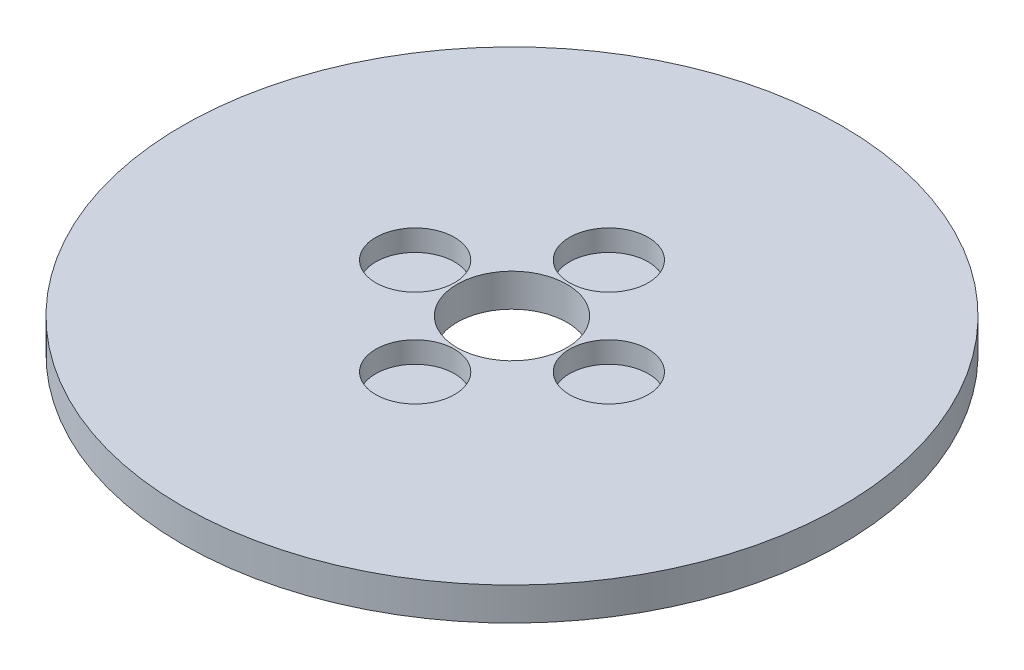
ISO-10303-21;
HEADER;
FILE_DESCRIPTION(('STEP AP214'),'2;1');
FILE_NAME('part.step','',(''),(''),'','','');
FILE_SCHEMA(('AUTOMOTIVE_DESIGN { 1 0 10303 214 1 1 1 1 }'));
ENDSEC;
DATA;
#1=APPLICATION_CONTEXT('core data for automotive mechanical design processes');
#2=APPLICATION_PROTOCOL_DEFINITION('international standard','automotive_design',2000,#1);
#3=PRODUCT_CONTEXT('',#1,'mechanical');
#4=PRODUCT('Part','Part','',(#3));
#5=PRODUCT_RELATED_PRODUCT_CATEGORY('part','',(#4));
#6=PRODUCT_DEFINITION_FORMATION('','',#4);
#7=PRODUCT_DEFINITION_CONTEXT('part definition',#1,'design');
#8=PRODUCT_DEFINITION('design','',#6,#7);
#9=PRODUCT_DEFINITION_SHAPE('','',#8);
#10=(LENGTH_UNIT() NAMED_UNIT(*) SI_UNIT(.MILLI.,.METRE.));
#11=(NAMED_UNIT(*) PLANE_ANGLE_UNIT() SI_UNIT($,.RADIAN.));
#12=(NAMED_UNIT(*) SI_UNIT($,.STERADIAN.) SOLID_ANGLE_UNIT());
#13=UNCERTAINTY_MEASURE_WITH_UNIT(LENGTH_MEASURE(1.E-05),#10,'distance_accuracy_value','');
#14=(GEOMETRIC_REPRESENTATION_CONTEXT(3) GLOBAL_UNCERTAINTY_ASSIGNED_CONTEXT((#13)) GLOBAL_UNIT_ASSIGNED_CONTEXT((#10,
#11,#12)) REPRESENTATION_CONTEXT('',''));
#15=CARTESIAN_POINT('',(0.,0.,0.));
#16=DIRECTION('',(0.,0.,1.));
#17=DIRECTION('',(1.,0.,0.));
#18=AXIS2_PLACEMENT_3D('',#15,#16,#17);
#19=CARTESIAN_POINT('',(0.,6.,0.));
#20=DIRECTION('',(0.,-1.,0.));
#21=DIRECTION('',(0.,0.,-1.));
#22=AXIS2_PLACEMENT_3D('',#19,#20,#21);
#23=CYLINDRICAL_SURFACE('',#22,60.);
#24=CARTESIAN_POINT('',(0.,6.,0.));
#25=DIRECTION('',(0.,1.,0.));
#26=DIRECTION('',(0.,0.,1.));
#27=AXIS2_PLACEMENT_3D('',#24,#25,#26);
#28=CIRCLE('',#27,60.);
#29=CARTESIAN_POINT('',(0.,6.,60.));
#30=VERTEX_POINT('',#29);
#31=EDGE_CURVE('E10',#30,#30,#28,.T.);
#32=ORIENTED_EDGE('',*,*,#31,.F.);
#33=EDGE_LOOP('',(#32));
#34=FACE_BOUND('',#33,.T.);
#35=CARTESIAN_POINT('',(0.,0.,0.));
#36=DIRECTION('',(0.,1.,0.));
#37=DIRECTION('',(0.,0.,1.));
#38=AXIS2_PLACEMENT_3D('',#35,#36,#37);
#39=CIRCLE('',#38,60.);
#40=CARTESIAN_POINT('',(0.,0.,60.));
#41=VERTEX_POINT('',#40);
#42=EDGE_CURVE('E37',#41,#41,#39,.T.);
#43=ORIENTED_EDGE('',*,*,#42,.T.);
#44=EDGE_LOOP('',(#43));
#45=FACE_BOUND('',#44,.T.);
#46=ADVANCED_FACE('F40',(#34,#45),#23,.T.);
#47=CARTESIAN_POINT('',(0.,6.,0.));
#48=DIRECTION('',(0.,1.,0.));
#49=DIRECTION('',(0.,0.,1.));
#50=AXIS2_PLACEMENT_3D('',#47,#48,#49);
#51=PLANE('',#50);
#52=CARTESIAN_POINT('',(0.,6.,17.6348314815398));
#53=DIRECTION('',(0.,1.,0.));
#54=DIRECTION('',(1.,0.,0.));
#55=AXIS2_PLACEMENT_3D('',#52,#53,#54);
#56=CIRCLE('',#55,7.16713873686793);
#57=CARTESIAN_POINT('',(0.,6.,24.8019702184078));
#58=VERTEX_POINT('',#57);
#59=EDGE_CURVE('E71',#58,#58,#56,.T.);
#60=ORIENTED_EDGE('',*,*,#59,.F.);
#61=EDGE_LOOP('',(#60));
#62=FACE_BOUND('',#61,.T.);
#63=CARTESIAN_POINT('',(17.6348314815398,6.,0.));
#64=DIRECTION('',(0.,1.,0.));
#65=DIRECTION('',(0.,0.,-1.));
#66=AXIS2_PLACEMENT_3D('',#63,#64,#65);
#67=CIRCLE('',#66,7.16713873686793);
#68=CARTESIAN_POINT('',(17.6348314815398,6.,7.16713873686793));
#69=VERTEX_POINT('',#68);
#70=EDGE_CURVE('E70',#69,#69,#67,.T.);
#71=ORIENTED_EDGE('',*,*,#70,.F.);
#72=EDGE_LOOP('',(#71));
#73=FACE_BOUND('',#72,.T.);
#74=CARTESIAN_POINT('',(-1.84715055094319E-13,6.,-17.6348314815398));
#75=DIRECTION('',(0.,1.,0.));
#76=DIRECTION('',(-1.,0.,0.));
#77=AXIS2_PLACEMENT_3D('',#74,#75,#76);
#78=CIRCLE('',#77,7.16713873686793);
#79=CARTESIAN_POINT('',(-1.84715055094319E-13,6.,-10.4676927446719));
#80=VERTEX_POINT('',#79);
#81=EDGE_CURVE('E61',#80,#80,#78,.T.);
#82=ORIENTED_EDGE('',*,*,#81,.F.);
#83=EDGE_LOOP('',(#82));
#84=FACE_BOUND('',#83,.T.);
#85=CARTESIAN_POINT('',(-17.6348314815398,6.,0.));
#86=DIRECTION('',(0.,1.,0.));
#87=DIRECTION('',(0.,0.,1.));
#88=AXIS2_PLACEMENT_3D('',#85,#86,#87);
#89=CIRCLE('',#88,7.16713873686793);
#90=CARTESIAN_POINT('',(-17.6348314815398,6.,7.16713873686793));
#91=VERTEX_POINT('',#90);
#92=EDGE_CURVE('E54',#91,#91,#89,.T.);
#93=ORIENTED_EDGE('',*,*,#92,.F.);
#94=EDGE_LOOP('',(#93));
#95=FACE_BOUND('',#94,.T.);
#96=CARTESIAN_POINT('',(0.,6.,0.));
#97=DIRECTION('',(0.,1.,0.));
#98=DIRECTION('',(0.,0.,1.));
#99=AXIS2_PLACEMENT_3D('',#96,#97,#98);
#100=CIRCLE('',#99,10.);
#101=CARTESIAN_POINT('',(0.,6.,10.));
#102=VERTEX_POINT('',#101);
#103=EDGE_CURVE('E50',#102,#102,#100,.T.);
#104=ORIENTED_EDGE('',*,*,#103,.F.);
#105=EDGE_LOOP('',(#104));
#106=FACE_BOUND('',#105,.T.);
#107=ORIENTED_EDGE('',*,*,#31,.T.);
#108=EDGE_LOOP('',(#107));
#109=FACE_BOUND('',#108,.T.);
#110=ADVANCED_FACE('F86',(#62,#73,#84,#95,#106,#109),#51,.T.);
#111=CARTESIAN_POINT('',(0.,0.,0.));
#112=DIRECTION('',(0.,1.,0.));
#113=DIRECTION('',(0.,0.,1.));
#114=AXIS2_PLACEMENT_3D('',#111,#112,#113);
#115=PLANE('',#114);
#116=CARTESIAN_POINT('',(0.,0.,0.));
#117=DIRECTION('',(0.,1.,0.));
#118=DIRECTION('',(0.,0.,1.));
#119=AXIS2_PLACEMENT_3D('',#116,#117,#118);
#120=CIRCLE('',#119,10.);
#121=CARTESIAN_POINT('',(0.,0.,10.));
#122=VERTEX_POINT('',#121);
#123=EDGE_CURVE('E47',#122,#122,#120,.T.);
#124=ORIENTED_EDGE('',*,*,#123,.T.);
#125=EDGE_LOOP('',(#124));
#126=FACE_BOUND('',#125,.T.);
#127=ORIENTED_EDGE('',*,*,#42,.F.);
#128=EDGE_LOOP('',(#127));
#129=FACE_BOUND('',#128,.T.);
#130=ADVANCED_FACE('F93',(#126,#129),#115,.F.);
#131=CARTESIAN_POINT('',(0.,6.,0.));
#132=DIRECTION('',(0.,-1.,0.));
#133=DIRECTION('',(0.,0.,-1.));
#134=AXIS2_PLACEMENT_3D('',#131,#132,#133);
#135=CYLINDRICAL_SURFACE('',#134,10.);
#136=ORIENTED_EDGE('',*,*,#103,.T.);
#137=EDGE_LOOP('',(#136));
#138=FACE_BOUND('',#137,.T.);
#139=ORIENTED_EDGE('',*,*,#123,.F.);
#140=EDGE_LOOP('',(#139));
#141=FACE_BOUND('',#140,.T.);
#142=ADVANCED_FACE('F101',(#138,#141),#135,.F.);
#143=CARTESIAN_POINT('',(-17.6348314815398,2.1339255998635,0.));
#144=DIRECTION('',(0.,1.,0.));
#145=DIRECTION('',(0.,0.,1.));
#146=AXIS2_PLACEMENT_3D('',#143,#144,#145);
#147=CYLINDRICAL_SURFACE('',#146,7.16713873686793);
#148=CARTESIAN_POINT('',(-17.6348314815398,2.1339255998635,0.));
#149=DIRECTION('',(0.,1.,0.));
#150=DIRECTION('',(0.,0.,1.));
#151=AXIS2_PLACEMENT_3D('',#148,#149,#150);
#152=CIRCLE('',#151,7.16713873686793);
#153=CARTESIAN_POINT('',(-17.6348314815398,2.1339255998635,7.16713873686793));
#154=VERTEX_POINT('',#153);
#155=EDGE_CURVE('E55',#154,#154,#152,.T.);
#156=CARTESIAN_POINT('',(-17.6348314815398,2.1339255998635,7.16713873686793));
#157=CARTESIAN_POINT('',(-17.6348314815398,2.17419720819826,7.16713873686793));
#158=CARTESIAN_POINT('',(-17.6348314815398,2.21446881653301,7.16713873686793));
#159=CARTESIAN_POINT('',(-17.6348314815398,2.29501203320252,7.16713873686793));
#160=CARTESIAN_POINT('',(-17.6348314815398,2.33528364153728,7.16713873686793));
#161=CARTESIAN_POINT('',(-17.6348314815398,2.41582685820679,7.16713873686793));
#162=CARTESIAN_POINT('',(-17.6348314815398,2.45609846654154,7.16713873686793));
#163=CARTESIAN_POINT('',(-17.6348314815398,2.53664168321105,7.16713873686793));
#164=CARTESIAN_POINT('',(-17.6348314815398,2.57691329154581,7.16713873686793));
#165=CARTESIAN_POINT('',(-17.6348314815398,2.65745650821532,7.16713873686793));
#166=CARTESIAN_POINT('',(-17.6348314815398,2.69772811655007,7.16713873686793));
#167=CARTESIAN_POINT('',(-17.6348314815398,2.77827133321958,7.16713873686793));
#168=CARTESIAN_POINT('',(-17.6348314815398,2.81854294155434,7.16713873686793));
#169=CARTESIAN_POINT('',(-17.6348314815398,2.89908615822385,7.16713873686793));
#170=CARTESIAN_POINT('',(-17.6348314815398,2.93935776655861,7.16713873686793));
#171=CARTESIAN_POINT('',(-17.6348314815398,3.01990098322812,7.16713873686793));
#172=CARTESIAN_POINT('',(-17.6348314815398,3.06017259156287,7.16713873686793));
#173=CARTESIAN_POINT('',(-17.6348314815398,3.14071580823238,7.16713873686793));
#174=CARTESIAN_POINT('',(-17.6348314815398,3.18098741656714,7.16713873686793));
#175=CARTESIAN_POINT('',(-17.6348314815398,3.26153063323665,7.16713873686793));
#176=CARTESIAN_POINT('',(-17.6348314815398,3.3018022415714,7.16713873686793));
#177=CARTESIAN_POINT('',(-17.6348314815398,3.38234545824091,7.16713873686793));
#178=CARTESIAN_POINT('',(-17.6348314815398,3.42261706657567,7.16713873686793));
#179=CARTESIAN_POINT('',(-17.6348314815398,3.50316028324518,7.16713873686793));
#180=CARTESIAN_POINT('',(-17.6348314815398,3.54343189157993,7.16713873686793));
#181=CARTESIAN_POINT('',(-17.6348314815398,3.62397510824944,7.16713873686793));
#182=CARTESIAN_POINT('',(-17.6348314815398,3.6642467165842,7.16713873686793));
#183=CARTESIAN_POINT('',(-17.6348314815398,3.74478993325371,7.16713873686793));
#184=CARTESIAN_POINT('',(-17.6348314815398,3.78506154158846,7.16713873686793));
#185=CARTESIAN_POINT('',(-17.6348314815398,3.86560475825797,7.16713873686793));
#186=CARTESIAN_POINT('',(-17.6348314815398,3.90587636659273,7.16713873686793));
#187=CARTESIAN_POINT('',(-17.6348314815398,3.98641958326224,7.16713873686793));
#188=CARTESIAN_POINT('',(-17.6348314815398,4.02669119159699,7.16713873686793));
#189=CARTESIAN_POINT('',(-17.6348314815398,4.10723440826651,7.16713873686793));
#190=CARTESIAN_POINT('',(-17.6348314815398,4.14750601660126,7.16713873686793));
#191=CARTESIAN_POINT('',(-17.6348314815398,4.22804923327077,7.16713873686793));
#192=CARTESIAN_POINT('',(-17.6348314815398,4.26832084160553,7.16713873686793));
#193=CARTESIAN_POINT('',(-17.6348314815398,4.34886405827504,7.16713873686793));
#194=CARTESIAN_POINT('',(-17.6348314815398,4.38913566660979,7.16713873686793));
#195=CARTESIAN_POINT('',(-17.6348314815398,4.4696788832793,7.16713873686793));
#196=CARTESIAN_POINT('',(-17.6348314815398,4.50995049161406,7.16713873686793));
#197=CARTESIAN_POINT('',(-17.6348314815398,4.59049370828357,7.16713873686793));
#198=CARTESIAN_POINT('',(-17.6348314815398,4.63076531661832,7.16713873686793));
#199=CARTESIAN_POINT('',(-17.6348314815398,4.71130853328783,7.16713873686793));
#200=CARTESIAN_POINT('',(-17.6348314815398,4.75158014162259,7.16713873686793));
#201=CARTESIAN_POINT('',(-17.6348314815398,4.8321233582921,7.16713873686793));
#202=CARTESIAN_POINT('',(-17.6348314815398,4.87239496662685,7.16713873686793));
#203=CARTESIAN_POINT('',(-17.6348314815398,4.95293818329636,7.16713873686793));
#204=CARTESIAN_POINT('',(-17.6348314815398,4.99320979163112,7.16713873686793));
#205=CARTESIAN_POINT('',(-17.6348314815398,5.07375300830063,7.16713873686793));
#206=CARTESIAN_POINT('',(-17.6348314815398,5.11402461663539,7.16713873686793));
#207=CARTESIAN_POINT('',(-17.6348314815398,5.1945678333049,7.16713873686793));
#208=CARTESIAN_POINT('',(-17.6348314815398,5.23483944163965,7.16713873686793));
#209=CARTESIAN_POINT('',(-17.6348314815398,5.31538265830916,7.16713873686793));
#210=CARTESIAN_POINT('',(-17.6348314815398,5.35565426664392,7.16713873686793));
#211=CARTESIAN_POINT('',(-17.6348314815398,5.43619748331343,7.16713873686793));
#212=CARTESIAN_POINT('',(-17.6348314815398,5.47646909164818,7.16713873686793));
#213=CARTESIAN_POINT('',(-17.6348314815398,5.55701230831769,7.16713873686793));
#214=CARTESIAN_POINT('',(-17.6348314815398,5.59728391665245,7.16713873686793));
#215=CARTESIAN_POINT('',(-17.6348314815398,5.67782713332196,7.16713873686793));
#216=CARTESIAN_POINT('',(-17.6348314815398,5.71809874165671,7.16713873686793));
#217=CARTESIAN_POINT('',(-17.6348314815398,5.79864195832622,7.16713873686793));
#218=CARTESIAN_POINT('',(-17.6348314815398,5.83891356666098,7.16713873686793));
#219=CARTESIAN_POINT('',(-17.6348314815398,5.91945678333049,7.16713873686793));
#220=CARTESIAN_POINT('',(-17.6348314815398,5.95972839166524,7.16713873686793));
#221=CARTESIAN_POINT('',(-17.6348314815398,6.,7.16713873686793));
#222=B_SPLINE_CURVE_WITH_KNOTS('',3,(#156,#157,#158,#159,#160,#161,#162,#163,#164,#165,#166,
#167,#168,#169,#170,#171,#172,#173,#174,#175,#176,#177,#178,#179,#180,#181,#182,#183,#184,#185,
#186,#187,#188,#189,#190,#191,#192,#193,#194,#195,#196,#197,#198,#199,#200,#201,#202,#203,#204,
#205,#206,#207,#208,#209,#210,#211,#212,#213,#214,#215,#216,#217,#218,#219,#220,#221),
.UNSPECIFIED.,.F.,.F.,(4,2,2,2,2,2,2,2,2,2,2,2,2,2,2,2,2,2,2,2,2,2,2,2,2,2,2,2,2,2,2,2,4),(0.,
0.120814825004265,0.241629650008531,0.362444475012796,0.483259300017062,0.604074125021328,
0.724888950025593,0.845703775029859,0.966518600034124,1.08733342503839,1.20814825004266,
1.32896307504692,1.44977790005119,1.57059272505545,1.69140755005972,1.81222237506398,
1.93303720006825,2.05385202507251,2.17466685007678,2.29548167508104,2.41629650008531,
2.53711132508958,2.65792615009384,2.77874097509811,2.89955580010237,3.02037062510664,
3.1411854501109,3.26200027511517,3.38281510011943,3.5036299251237,3.62444475012797,
3.74525957513223,3.8660744001365),.UNSPECIFIED.);
#223=EDGE_CURVE('BSEAM102',#154,#91,#222,.T.);
#224=ORIENTED_EDGE('',*,*,#155,.F.);
#225=ORIENTED_EDGE('',*,*,#92,.T.);
#226=ORIENTED_EDGE('',*,*,#223,.T.);
#227=ORIENTED_EDGE('',*,*,#223,.F.);
#228=EDGE_LOOP('',(#224,#226,#225,#227));
#229=FACE_BOUND('',#228,.T.);
#230=ADVANCED_FACE('F102',(#229),#147,.F.);
#231=CARTESIAN_POINT('',(-17.6348314815398,2.1339255998635,0.));
#232=DIRECTION('',(0.,1.,0.));
#233=DIRECTION('',(0.,0.,1.));
#234=AXIS2_PLACEMENT_3D('',#231,#232,#233);
#235=PLANE('',#234);
#236=ORIENTED_EDGE('',*,*,#155,.T.);
#237=EDGE_LOOP('',(#236));
#238=FACE_BOUND('',#237,.T.);
#239=ADVANCED_FACE('F133',(#238),#235,.T.);
#240=CARTESIAN_POINT('',(-1.84715055094319E-13,2.1339255998635,-17.6348314815398));
#241=DIRECTION('',(0.,1.,0.));
#242=DIRECTION('',(0.,0.,1.));
#243=AXIS2_PLACEMENT_3D('',#240,#241,#242);
#244=CYLINDRICAL_SURFACE('',#243,7.16713873686793);
#245=CARTESIAN_POINT('',(-1.84715055094319E-13,2.1339255998635,-17.6348314815398));
#246=DIRECTION('',(0.,1.,0.));
#247=DIRECTION('',(-1.,0.,0.));
#248=AXIS2_PLACEMENT_3D('',#245,#246,#247);
#249=CIRCLE('',#248,7.16713873686793);
#250=CARTESIAN_POINT('',(-1.84715055094319E-13,2.1339255998635,-10.4676927446719));
#251=VERTEX_POINT('',#250);
#252=EDGE_CURVE('E63',#251,#251,#249,.T.);
#253=CARTESIAN_POINT('',(-1.84715055094319E-13,2.1339255998635,-10.4676927446719));
#254=CARTESIAN_POINT('',(-1.84715055094319E-13,2.17419720819826,-10.4676927446719));
#255=CARTESIAN_POINT('',(-1.84715055094319E-13,2.21446881653301,-10.4676927446719));
#256=CARTESIAN_POINT('',(-1.84715055094319E-13,2.29501203320252,-10.4676927446719));
#257=CARTESIAN_POINT('',(-1.84715055094319E-13,2.33528364153728,-10.4676927446719));
#258=CARTESIAN_POINT('',(-1.84715055094319E-13,2.41582685820679,-10.4676927446719));
#259=CARTESIAN_POINT('',(-1.84715055094319E-13,2.45609846654154,-10.4676927446719));
#260=CARTESIAN_POINT('',(-1.84715055094319E-13,2.53664168321105,-10.4676927446719));
#261=CARTESIAN_POINT('',(-1.84715055094319E-13,2.57691329154581,-10.4676927446719));
#262=CARTESIAN_POINT('',(-1.84715055094319E-13,2.65745650821532,-10.4676927446719));
#263=CARTESIAN_POINT('',(-1.84715055094319E-13,2.69772811655007,-10.4676927446719));
#264=CARTESIAN_POINT('',(-1.84715055094319E-13,2.77827133321958,-10.4676927446719));
#265=CARTESIAN_POINT('',(-1.84715055094319E-13,2.81854294155434,-10.4676927446719));
#266=CARTESIAN_POINT('',(-1.84715055094319E-13,2.89908615822385,-10.4676927446719));
#267=CARTESIAN_POINT('',(-1.84715055094319E-13,2.93935776655861,-10.4676927446719));
#268=CARTESIAN_POINT('',(-1.84715055094319E-13,3.01990098322812,-10.4676927446719));
#269=CARTESIAN_POINT('',(-1.84715055094319E-13,3.06017259156287,-10.4676927446719));
#270=CARTESIAN_POINT('',(-1.84715055094319E-13,3.14071580823238,-10.4676927446719));
#271=CARTESIAN_POINT('',(-1.84715055094319E-13,3.18098741656714,-10.4676927446719));
#272=CARTESIAN_POINT('',(-1.84715055094319E-13,3.26153063323665,-10.4676927446719));
#273=CARTESIAN_POINT('',(-1.84715055094319E-13,3.3018022415714,-10.4676927446719));
#274=CARTESIAN_POINT('',(-1.84715055094319E-13,3.38234545824091,-10.4676927446719));
#275=CARTESIAN_POINT('',(-1.84715055094319E-13,3.42261706657567,-10.4676927446719));
#276=CARTESIAN_POINT('',(-1.84715055094319E-13,3.50316028324518,-10.4676927446719));
#277=CARTESIAN_POINT('',(-1.84715055094319E-13,3.54343189157993,-10.4676927446719));
#278=CARTESIAN_POINT('',(-1.84715055094319E-13,3.62397510824944,-10.4676927446719));
#279=CARTESIAN_POINT('',(-1.84715055094319E-13,3.6642467165842,-10.4676927446719));
#280=CARTESIAN_POINT('',(-1.84715055094319E-13,3.74478993325371,-10.4676927446719));
#281=CARTESIAN_POINT('',(-1.84715055094319E-13,3.78506154158846,-10.4676927446719));
#282=CARTESIAN_POINT('',(-1.84715055094319E-13,3.86560475825797,-10.4676927446719));
#283=CARTESIAN_POINT('',(-1.84715055094319E-13,3.90587636659273,-10.4676927446719));
#284=CARTESIAN_POINT('',(-1.84715055094319E-13,3.98641958326224,-10.4676927446719));
#285=CARTESIAN_POINT('',(-1.84715055094319E-13,4.02669119159699,-10.4676927446719));
#286=CARTESIAN_POINT('',(-1.84715055094319E-13,4.10723440826651,-10.4676927446719));
#287=CARTESIAN_POINT('',(-1.84715055094319E-13,4.14750601660126,-10.4676927446719));
#288=CARTESIAN_POINT('',(-1.84715055094319E-13,4.22804923327077,-10.4676927446719));
#289=CARTESIAN_POINT('',(-1.84715055094319E-13,4.26832084160553,-10.4676927446719));
#290=CARTESIAN_POINT('',(-1.84715055094319E-13,4.34886405827504,-10.4676927446719));
#291=CARTESIAN_POINT('',(-1.84715055094319E-13,4.38913566660979,-10.4676927446719));
#292=CARTESIAN_POINT('',(-1.84715055094319E-13,4.4696788832793,-10.4676927446719));
#293=CARTESIAN_POINT('',(-1.84715055094319E-13,4.50995049161406,-10.4676927446719));
#294=CARTESIAN_POINT('',(-1.84715055094319E-13,4.59049370828357,-10.4676927446719));
#295=CARTESIAN_POINT('',(-1.84715055094319E-13,4.63076531661832,-10.4676927446719));
#296=CARTESIAN_POINT('',(-1.84715055094319E-13,4.71130853328783,-10.4676927446719));
#297=CARTESIAN_POINT('',(-1.84715055094319E-13,4.75158014162259,-10.4676927446719));
#298=CARTESIAN_POINT('',(-1.84715055094319E-13,4.8321233582921,-10.4676927446719));
#299=CARTESIAN_POINT('',(-1.84715055094319E-13,4.87239496662685,-10.4676927446719));
#300=CARTESIAN_POINT('',(-1.84715055094319E-13,4.95293818329636,-10.4676927446719));
#301=CARTESIAN_POINT('',(-1.84715055094319E-13,4.99320979163112,-10.4676927446719));
#302=CARTESIAN_POINT('',(-1.84715055094319E-13,5.07375300830063,-10.4676927446719));
#303=CARTESIAN_POINT('',(-1.84715055094319E-13,5.11402461663539,-10.4676927446719));
#304=CARTESIAN_POINT('',(-1.84715055094319E-13,5.1945678333049,-10.4676927446719));
#305=CARTESIAN_POINT('',(-1.84715055094319E-13,5.23483944163965,-10.4676927446719));
#306=CARTESIAN_POINT('',(-1.84715055094319E-13,5.31538265830916,-10.4676927446719));
#307=CARTESIAN_POINT('',(-1.84715055094319E-13,5.35565426664392,-10.4676927446719));
#308=CARTESIAN_POINT('',(-1.84715055094319E-13,5.43619748331343,-10.4676927446719));
#309=CARTESIAN_POINT('',(-1.84715055094319E-13,5.47646909164818,-10.4676927446719));
#310=CARTESIAN_POINT('',(-1.84715055094319E-13,5.55701230831769,-10.4676927446719));
#311=CARTESIAN_POINT('',(-1.84715055094319E-13,5.59728391665245,-10.4676927446719));
#312=CARTESIAN_POINT('',(-1.84715055094319E-13,5.67782713332196,-10.4676927446719));
#313=CARTESIAN_POINT('',(-1.84715055094319E-13,5.71809874165671,-10.4676927446719));
#314=CARTESIAN_POINT('',(-1.84715055094319E-13,5.79864195832622,-10.4676927446719));
#315=CARTESIAN_POINT('',(-1.84715055094319E-13,5.83891356666098,-10.4676927446719));
#316=CARTESIAN_POINT('',(-1.84715055094319E-13,5.91945678333049,-10.4676927446719));
#317=CARTESIAN_POINT('',(-1.84715055094319E-13,5.95972839166524,-10.4676927446719));
#318=CARTESIAN_POINT('',(-1.84715055094319E-13,6.,-10.4676927446719));
#319=B_SPLINE_CURVE_WITH_KNOTS('',3,(#253,#254,#255,#256,#257,#258,#259,#260,#261,#262,#263,
#264,#265,#266,#267,#268,#269,#270,#271,#272,#273,#274,#275,#276,#277,#278,#279,#280,#281,#282,
#283,#284,#285,#286,#287,#288,#289,#290,#291,#292,#293,#294,#295,#296,#297,#298,#299,#300,#301,
#302,#303,#304,#305,#306,#307,#308,#309,#310,#311,#312,#313,#314,#315,#316,#317,#318),
.UNSPECIFIED.,.F.,.F.,(4,2,2,2,2,2,2,2,2,2,2,2,2,2,2,2,2,2,2,2,2,2,2,2,2,2,2,2,2,2,2,2,4),(0.,
0.120814825004265,0.241629650008531,0.362444475012796,0.483259300017062,0.604074125021328,
0.724888950025593,0.845703775029859,0.966518600034124,1.08733342503839,1.20814825004266,
1.32896307504692,1.44977790005119,1.57059272505545,1.69140755005972,1.81222237506398,
1.93303720006825,2.05385202507251,2.17466685007678,2.29548167508104,2.41629650008531,
2.53711132508958,2.65792615009384,2.77874097509811,2.89955580010237,3.02037062510664,
3.1411854501109,3.26200027511517,3.38281510011943,3.5036299251237,3.62444475012797,
3.74525957513223,3.8660744001365),.UNSPECIFIED.);
#320=EDGE_CURVE('BSEAM142',#251,#80,#319,.T.);
#321=ORIENTED_EDGE('',*,*,#252,.F.);
#322=ORIENTED_EDGE('',*,*,#81,.T.);
#323=ORIENTED_EDGE('',*,*,#320,.T.);
#324=ORIENTED_EDGE('',*,*,#320,.F.);
#325=EDGE_LOOP('',(#321,#323,#322,#324));
#326=FACE_BOUND('',#325,.T.);
#327=ADVANCED_FACE('F142',(#326),#244,.F.);
#328=CARTESIAN_POINT('',(-1.84715055094319E-13,2.1339255998635,-17.6348314815398));
#329=DIRECTION('',(0.,1.,0.));
#330=DIRECTION('',(-1.,0.,0.));
#331=AXIS2_PLACEMENT_3D('',#328,#329,#330);
#332=PLANE('',#331);
#333=ORIENTED_EDGE('',*,*,#252,.T.);
#334=EDGE_LOOP('',(#333));
#335=FACE_BOUND('',#334,.T.);
#336=ADVANCED_FACE('F156',(#335),#332,.T.);
#337=CARTESIAN_POINT('',(17.6348314815398,2.1339255998635,0.));
#338=DIRECTION('',(0.,1.,0.));
#339=DIRECTION('',(0.,0.,1.));
#340=AXIS2_PLACEMENT_3D('',#337,#338,#339);
#341=CYLINDRICAL_SURFACE('',#340,7.16713873686793);
#342=CARTESIAN_POINT('',(17.6348314815398,2.1339255998635,0.));
#343=DIRECTION('',(0.,1.,0.));
#344=DIRECTION('',(0.,0.,-1.));
#345=AXIS2_PLACEMENT_3D('',#342,#343,#344);
#346=CIRCLE('',#345,7.16713873686793);
#347=CARTESIAN_POINT('',(17.6348314815398,2.1339255998635,7.16713873686793));
#348=VERTEX_POINT('',#347);
#349=EDGE_CURVE('E69',#348,#348,#346,.T.);
#350=CARTESIAN_POINT('',(17.6348314815398,2.1339255998635,7.16713873686793));
#351=CARTESIAN_POINT('',(17.6348314815398,2.17419720819826,7.16713873686793));
#352=CARTESIAN_POINT('',(17.6348314815398,2.21446881653301,7.16713873686793));
#353=CARTESIAN_POINT('',(17.6348314815398,2.29501203320252,7.16713873686793));
#354=CARTESIAN_POINT('',(17.6348314815398,2.33528364153728,7.16713873686793));
#355=CARTESIAN_POINT('',(17.6348314815398,2.41582685820679,7.16713873686793));
#356=CARTESIAN_POINT('',(17.6348314815398,2.45609846654154,7.16713873686793));
#357=CARTESIAN_POINT('',(17.6348314815398,2.53664168321105,7.16713873686793));
#358=CARTESIAN_POINT('',(17.6348314815398,2.57691329154581,7.16713873686793));
#359=CARTESIAN_POINT('',(17.6348314815398,2.65745650821532,7.16713873686793));
#360=CARTESIAN_POINT('',(17.6348314815398,2.69772811655007,7.16713873686793));
#361=CARTESIAN_POINT('',(17.6348314815398,2.77827133321958,7.16713873686793));
#362=CARTESIAN_POINT('',(17.6348314815398,2.81854294155434,7.16713873686793));
#363=CARTESIAN_POINT('',(17.6348314815398,2.89908615822385,7.16713873686793));
#364=CARTESIAN_POINT('',(17.6348314815398,2.93935776655861,7.16713873686793));
#365=CARTESIAN_POINT('',(17.6348314815398,3.01990098322812,7.16713873686793));
#366=CARTESIAN_POINT('',(17.6348314815398,3.06017259156287,7.16713873686793));
#367=CARTESIAN_POINT('',(17.6348314815398,3.14071580823238,7.16713873686793));
#368=CARTESIAN_POINT('',(17.6348314815398,3.18098741656714,7.16713873686793));
#369=CARTESIAN_POINT('',(17.6348314815398,3.26153063323665,7.16713873686793));
#370=CARTESIAN_POINT('',(17.6348314815398,3.3018022415714,7.16713873686793));
#371=CARTESIAN_POINT('',(17.6348314815398,3.38234545824091,7.16713873686793));
#372=CARTESIAN_POINT('',(17.6348314815398,3.42261706657567,7.16713873686793));
#373=CARTESIAN_POINT('',(17.6348314815398,3.50316028324518,7.16713873686793));
#374=CARTESIAN_POINT('',(17.6348314815398,3.54343189157993,7.16713873686793));
#375=CARTESIAN_POINT('',(17.6348314815398,3.62397510824944,7.16713873686793));
#376=CARTESIAN_POINT('',(17.6348314815398,3.6642467165842,7.16713873686793));
#377=CARTESIAN_POINT('',(17.6348314815398,3.74478993325371,7.16713873686793));
#378=CARTESIAN_POINT('',(17.6348314815398,3.78506154158846,7.16713873686793));
#379=CARTESIAN_POINT('',(17.6348314815398,3.86560475825797,7.16713873686793));
#380=CARTESIAN_POINT('',(17.6348314815398,3.90587636659273,7.16713873686793));
#381=CARTESIAN_POINT('',(17.6348314815398,3.98641958326224,7.16713873686793));
#382=CARTESIAN_POINT('',(17.6348314815398,4.02669119159699,7.16713873686793));
#383=CARTESIAN_POINT('',(17.6348314815398,4.10723440826651,7.16713873686793));
#384=CARTESIAN_POINT('',(17.6348314815398,4.14750601660126,7.16713873686793));
#385=CARTESIAN_POINT('',(17.6348314815398,4.22804923327077,7.16713873686793));
#386=CARTESIAN_POINT('',(17.6348314815398,4.26832084160553,7.16713873686793));
#387=CARTESIAN_POINT('',(17.6348314815398,4.34886405827504,7.16713873686793));
#388=CARTESIAN_POINT('',(17.6348314815398,4.38913566660979,7.16713873686793));
#389=CARTESIAN_POINT('',(17.6348314815398,4.4696788832793,7.16713873686793));
#390=CARTESIAN_POINT('',(17.6348314815398,4.50995049161406,7.16713873686793));
#391=CARTESIAN_POINT('',(17.6348314815398,4.59049370828357,7.16713873686793));
#392=CARTESIAN_POINT('',(17.6348314815398,4.63076531661832,7.16713873686793));
#393=CARTESIAN_POINT('',(17.6348314815398,4.71130853328783,7.16713873686793));
#394=CARTESIAN_POINT('',(17.6348314815398,4.75158014162259,7.16713873686793));
#395=CARTESIAN_POINT('',(17.6348314815398,4.8321233582921,7.16713873686793));
#396=CARTESIAN_POINT('',(17.6348314815398,4.87239496662685,7.16713873686793));
#397=CARTESIAN_POINT('',(17.6348314815398,4.95293818329636,7.16713873686793));
#398=CARTESIAN_POINT('',(17.6348314815398,4.99320979163112,7.16713873686793));
#399=CARTESIAN_POINT('',(17.6348314815398,5.07375300830063,7.16713873686793));
#400=CARTESIAN_POINT('',(17.6348314815398,5.11402461663539,7.16713873686793));
#401=CARTESIAN_POINT('',(17.6348314815398,5.1945678333049,7.16713873686793));
#402=CARTESIAN_POINT('',(17.6348314815398,5.23483944163965,7.16713873686793));
#403=CARTESIAN_POINT('',(17.6348314815398,5.31538265830916,7.16713873686793));
#404=CARTESIAN_POINT('',(17.6348314815398,5.35565426664392,7.16713873686793));
#405=CARTESIAN_POINT('',(17.6348314815398,5.43619748331343,7.16713873686793));
#406=CARTESIAN_POINT('',(17.6348314815398,5.47646909164818,7.16713873686793));
#407=CARTESIAN_POINT('',(17.6348314815398,5.55701230831769,7.16713873686793));
#408=CARTESIAN_POINT('',(17.6348314815398,5.59728391665245,7.16713873686793));
#409=CARTESIAN_POINT('',(17.6348314815398,5.67782713332196,7.16713873686793));
#410=CARTESIAN_POINT('',(17.6348314815398,5.71809874165671,7.16713873686793));
#411=CARTESIAN_POINT('',(17.6348314815398,5.79864195832622,7.16713873686793));
#412=CARTESIAN_POINT('',(17.6348314815398,5.83891356666098,7.16713873686793));
#413=CARTESIAN_POINT('',(17.6348314815398,5.91945678333049,7.16713873686793));
#414=CARTESIAN_POINT('',(17.6348314815398,5.95972839166524,7.16713873686793));
#415=CARTESIAN_POINT('',(17.6348314815398,6.,7.16713873686793));
#416=B_SPLINE_CURVE_WITH_KNOTS('',3,(#350,#351,#352,#353,#354,#355,#356,#357,#358,#359,#360,
#361,#362,#363,#364,#365,#366,#367,#368,#369,#370,#371,#372,#373,#374,#375,#376,#377,#378,#379,
#380,#381,#382,#383,#384,#385,#386,#387,#388,#389,#390,#391,#392,#393,#394,#395,#396,#397,#398,
#399,#400,#401,#402,#403,#404,#405,#406,#407,#408,#409,#410,#411,#412,#413,#414,#415),
.UNSPECIFIED.,.F.,.F.,(4,2,2,2,2,2,2,2,2,2,2,2,2,2,2,2,2,2,2,2,2,2,2,2,2,2,2,2,2,2,2,2,4),(0.,
0.120814825004265,0.241629650008531,0.362444475012796,0.483259300017062,0.604074125021328,
0.724888950025593,0.845703775029859,0.966518600034124,1.08733342503839,1.20814825004266,
1.32896307504692,1.44977790005119,1.57059272505545,1.69140755005972,1.81222237506398,
1.93303720006825,2.05385202507251,2.17466685007678,2.29548167508104,2.41629650008531,
2.53711132508958,2.65792615009384,2.77874097509811,2.89955580010237,3.02037062510664,
3.1411854501109,3.26200027511517,3.38281510011943,3.5036299251237,3.62444475012797,
3.74525957513223,3.8660744001365),.UNSPECIFIED.);
#417=EDGE_CURVE('BSEAM164',#348,#69,#416,.T.);
#418=ORIENTED_EDGE('',*,*,#349,.F.);
#419=ORIENTED_EDGE('',*,*,#70,.T.);
#420=ORIENTED_EDGE('',*,*,#417,.T.);
#421=ORIENTED_EDGE('',*,*,#417,.F.);
#422=EDGE_LOOP('',(#418,#420,#419,#421));
#423=FACE_BOUND('',#422,.T.);
#424=ADVANCED_FACE('F164',(#423),#341,.F.);
#425=CARTESIAN_POINT('',(17.6348314815398,2.1339255998635,0.));
#426=DIRECTION('',(0.,1.,0.));
#427=DIRECTION('',(0.,0.,-1.));
#428=AXIS2_PLACEMENT_3D('',#425,#426,#427);
#429=PLANE('',#428);
#430=ORIENTED_EDGE('',*,*,#349,.T.);
#431=EDGE_LOOP('',(#430));
#432=FACE_BOUND('',#431,.T.);
#433=ADVANCED_FACE('F83',(#432),#429,.T.);
#434=CARTESIAN_POINT('',(0.,2.1339255998635,17.6348314815398));
#435=DIRECTION('',(0.,1.,0.));
#436=DIRECTION('',(0.,0.,1.));
#437=AXIS2_PLACEMENT_3D('',#434,#435,#436);
#438=CYLINDRICAL_SURFACE('',#437,7.16713873686793);
#439=CARTESIAN_POINT('',(0.,2.1339255998635,17.6348314815398));
#440=DIRECTION('',(0.,1.,0.));
#441=DIRECTION('',(1.,0.,0.));
#442=AXIS2_PLACEMENT_3D('',#439,#440,#441);
#443=CIRCLE('',#442,7.16713873686793);
#444=CARTESIAN_POINT('',(0.,2.1339255998635,24.8019702184078));
#445=VERTEX_POINT('',#444);
#446=EDGE_CURVE('E59',#445,#445,#443,.T.);
#447=CARTESIAN_POINT('',(0.,2.1339255998635,24.8019702184078));
#448=CARTESIAN_POINT('',(0.,2.17419720819826,24.8019702184078));
#449=CARTESIAN_POINT('',(0.,2.21446881653301,24.8019702184078));
#450=CARTESIAN_POINT('',(0.,2.29501203320252,24.8019702184078));
#451=CARTESIAN_POINT('',(0.,2.33528364153728,24.8019702184078));
#452=CARTESIAN_POINT('',(0.,2.41582685820679,24.8019702184078));
#453=CARTESIAN_POINT('',(0.,2.45609846654154,24.8019702184078));
#454=CARTESIAN_POINT('',(0.,2.53664168321105,24.8019702184078));
#455=CARTESIAN_POINT('',(0.,2.57691329154581,24.8019702184078));
#456=CARTESIAN_POINT('',(0.,2.65745650821532,24.8019702184078));
#457=CARTESIAN_POINT('',(0.,2.69772811655007,24.8019702184078));
#458=CARTESIAN_POINT('',(0.,2.77827133321958,24.8019702184078));
#459=CARTESIAN_POINT('',(0.,2.81854294155434,24.8019702184078));
#460=CARTESIAN_POINT('',(0.,2.89908615822385,24.8019702184078));
#461=CARTESIAN_POINT('',(0.,2.93935776655861,24.8019702184078));
#462=CARTESIAN_POINT('',(0.,3.01990098322812,24.8019702184078));
#463=CARTESIAN_POINT('',(0.,3.06017259156287,24.8019702184078));
#464=CARTESIAN_POINT('',(0.,3.14071580823238,24.8019702184078));
#465=CARTESIAN_POINT('',(0.,3.18098741656714,24.8019702184078));
#466=CARTESIAN_POINT('',(0.,3.26153063323665,24.8019702184078));
#467=CARTESIAN_POINT('',(0.,3.3018022415714,24.8019702184078));
#468=CARTESIAN_POINT('',(0.,3.38234545824091,24.8019702184078));
#469=CARTESIAN_POINT('',(0.,3.42261706657567,24.8019702184078));
#470=CARTESIAN_POINT('',(0.,3.50316028324518,24.8019702184078));
#471=CARTESIAN_POINT('',(0.,3.54343189157993,24.8019702184078));
#472=CARTESIAN_POINT('',(0.,3.62397510824944,24.8019702184078));
#473=CARTESIAN_POINT('',(0.,3.6642467165842,24.8019702184078));
#474=CARTESIAN_POINT('',(0.,3.74478993325371,24.8019702184078));
#475=CARTESIAN_POINT('',(0.,3.78506154158846,24.8019702184078));
#476=CARTESIAN_POINT('',(0.,3.86560475825797,24.8019702184078));
#477=CARTESIAN_POINT('',(0.,3.90587636659273,24.8019702184078));
#478=CARTESIAN_POINT('',(0.,3.98641958326224,24.8019702184078));
#479=CARTESIAN_POINT('',(0.,4.02669119159699,24.8019702184078));
#480=CARTESIAN_POINT('',(0.,4.10723440826651,24.8019702184078));
#481=CARTESIAN_POINT('',(0.,4.14750601660126,24.8019702184078));
#482=CARTESIAN_POINT('',(0.,4.22804923327077,24.8019702184078));
#483=CARTESIAN_POINT('',(0.,4.26832084160553,24.8019702184078));
#484=CARTESIAN_POINT('',(0.,4.34886405827504,24.8019702184078));
#485=CARTESIAN_POINT('',(0.,4.38913566660979,24.8019702184078));
#486=CARTESIAN_POINT('',(0.,4.4696788832793,24.8019702184078));
#487=CARTESIAN_POINT('',(0.,4.50995049161406,24.8019702184078));
#488=CARTESIAN_POINT('',(0.,4.59049370828357,24.8019702184078));
#489=CARTESIAN_POINT('',(0.,4.63076531661832,24.8019702184078));
#490=CARTESIAN_POINT('',(0.,4.71130853328783,24.8019702184078));
#491=CARTESIAN_POINT('',(0.,4.75158014162259,24.8019702184078));
#492=CARTESIAN_POINT('',(0.,4.8321233582921,24.8019702184078));
#493=CARTESIAN_POINT('',(0.,4.87239496662685,24.8019702184078));
#494=CARTESIAN_POINT('',(0.,4.95293818329636,24.8019702184078));
#495=CARTESIAN_POINT('',(0.,4.99320979163112,24.8019702184078));
#496=CARTESIAN_POINT('',(0.,5.07375300830063,24.8019702184078));
#497=CARTESIAN_POINT('',(0.,5.11402461663539,24.8019702184078));
#498=CARTESIAN_POINT('',(0.,5.1945678333049,24.8019702184078));
#499=CARTESIAN_POINT('',(0.,5.23483944163965,24.8019702184078));
#500=CARTESIAN_POINT('',(0.,5.31538265830916,24.8019702184078));
#501=CARTESIAN_POINT('',(0.,5.35565426664392,24.8019702184078));
#502=CARTESIAN_POINT('',(0.,5.43619748331343,24.8019702184078));
#503=CARTESIAN_POINT('',(0.,5.47646909164818,24.8019702184078));
#504=CARTESIAN_POINT('',(0.,5.55701230831769,24.8019702184078));
#505=CARTESIAN_POINT('',(0.,5.59728391665245,24.8019702184078));
#506=CARTESIAN_POINT('',(0.,5.67782713332196,24.8019702184078));
#507=CARTESIAN_POINT('',(0.,5.71809874165671,24.8019702184078));
#508=CARTESIAN_POINT('',(0.,5.79864195832622,24.8019702184078));
#509=CARTESIAN_POINT('',(0.,5.83891356666098,24.8019702184078));
#510=CARTESIAN_POINT('',(0.,5.91945678333049,24.8019702184078));
#511=CARTESIAN_POINT('',(0.,5.95972839166524,24.8019702184078));
#512=CARTESIAN_POINT('',(0.,6.,24.8019702184078));
#513=B_SPLINE_CURVE_WITH_KNOTS('',3,(#447,#448,#449,#450,#451,#452,#453,#454,#455,#456,#457,
#458,#459,#460,#461,#462,#463,#464,#465,#466,#467,#468,#469,#470,#471,#472,#473,#474,#475,#476,
#477,#478,#479,#480,#481,#482,#483,#484,#485,#486,#487,#488,#489,#490,#491,#492,#493,#494,#495,
#496,#497,#498,#499,#500,#501,#502,#503,#504,#505,#506,#507,#508,#509,#510,#511,#512),
.UNSPECIFIED.,.F.,.F.,(4,2,2,2,2,2,2,2,2,2,2,2,2,2,2,2,2,2,2,2,2,2,2,2,2,2,2,2,2,2,2,2,4),(0.,
0.120814825004265,0.241629650008531,0.362444475012796,0.483259300017062,0.604074125021328,
0.724888950025593,0.845703775029859,0.966518600034124,1.08733342503839,1.20814825004266,
1.32896307504692,1.44977790005119,1.57059272505545,1.69140755005972,1.81222237506398,
1.93303720006825,2.05385202507251,2.17466685007678,2.29548167508104,2.41629650008531,
2.53711132508958,2.65792615009384,2.77874097509811,2.89955580010237,3.02037062510664,
3.1411854501109,3.26200027511517,3.38281510011943,3.5036299251237,3.62444475012797,
3.74525957513223,3.8660744001365),.UNSPECIFIED.);
#514=EDGE_CURVE('BSEAM81',#445,#58,#513,.T.);
#515=ORIENTED_EDGE('',*,*,#446,.F.);
#516=ORIENTED_EDGE('',*,*,#59,.T.);
#517=ORIENTED_EDGE('',*,*,#514,.T.);
#518=ORIENTED_EDGE('',*,*,#514,.F.);
#519=EDGE_LOOP('',(#515,#517,#516,#518));
#520=FACE_BOUND('',#519,.T.);
#521=ADVANCED_FACE('F81',(#520),#438,.F.);
#522=CARTESIAN_POINT('',(0.,2.1339255998635,17.6348314815398));
#523=DIRECTION('',(0.,1.,0.));
#524=DIRECTION('',(1.,0.,0.));
#525=AXIS2_PLACEMENT_3D('',#522,#523,#524);
#526=PLANE('',#525);
#527=ORIENTED_EDGE('',*,*,#446,.T.);
#528=EDGE_LOOP('',(#527));
#529=FACE_BOUND('',#528,.T.);
#530=ADVANCED_FACE('F78',(#529),#526,.T.);
#531=CLOSED_SHELL('',(#46,#110,#130,#142,#230,#239,#327,#336,#424,#433,#521,#530));
#532=MANIFOLD_SOLID_BREP('B2',#531);
#533=ADVANCED_BREP_SHAPE_REPRESENTATION('',(#18,#532),#14);
#534=SHAPE_DEFINITION_REPRESENTATION(#9,#533);
ENDSEC;
END-ISO-10303-21;
